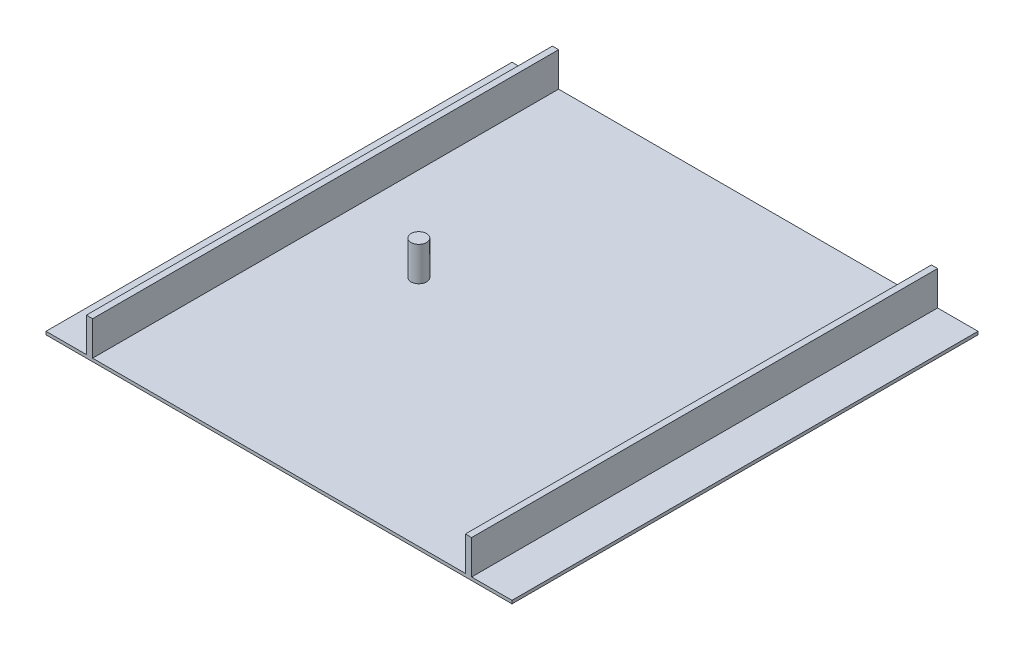
ISO-10303-21;
HEADER;
FILE_DESCRIPTION(('STEP AP214'),'2;1');
FILE_NAME('part.step','',(''),(''),'','','');
FILE_SCHEMA(('AUTOMOTIVE_DESIGN { 1 0 10303 214 1 1 1 1 }'));
ENDSEC;
DATA;
#1=APPLICATION_CONTEXT('core data for automotive mechanical design processes');
#2=APPLICATION_PROTOCOL_DEFINITION('international standard','automotive_design',2000,#1);
#3=PRODUCT_CONTEXT('',#1,'mechanical');
#4=PRODUCT('Part','Part','',(#3));
#5=PRODUCT_RELATED_PRODUCT_CATEGORY('part','',(#4));
#6=PRODUCT_DEFINITION_FORMATION('','',#4);
#7=PRODUCT_DEFINITION_CONTEXT('part definition',#1,'design');
#8=PRODUCT_DEFINITION('design','',#6,#7);
#9=PRODUCT_DEFINITION_SHAPE('','',#8);
#10=(LENGTH_UNIT() NAMED_UNIT(*) SI_UNIT(.MILLI.,.METRE.));
#11=(NAMED_UNIT(*) PLANE_ANGLE_UNIT() SI_UNIT($,.RADIAN.));
#12=(NAMED_UNIT(*) SI_UNIT($,.STERADIAN.) SOLID_ANGLE_UNIT());
#13=UNCERTAINTY_MEASURE_WITH_UNIT(LENGTH_MEASURE(1.E-05),#10,'distance_accuracy_value','');
#14=(GEOMETRIC_REPRESENTATION_CONTEXT(3) GLOBAL_UNCERTAINTY_ASSIGNED_CONTEXT((#13)) GLOBAL_UNIT_ASSIGNED_CONTEXT((#10,
#11,#12)) REPRESENTATION_CONTEXT('',''));
#15=CARTESIAN_POINT('',(0.,0.,0.));
#16=DIRECTION('',(0.,0.,1.));
#17=DIRECTION('',(1.,0.,0.));
#18=AXIS2_PLACEMENT_3D('',#15,#16,#17);
#19=CARTESIAN_POINT('',(0.,10.,0.));
#20=DIRECTION('',(0.,1.,0.));
#21=DIRECTION('',(0.,0.,1.));
#22=AXIS2_PLACEMENT_3D('',#19,#20,#21);
#23=PLANE('',#22);
#24=DIRECTION('',(1.,0.,0.));
#25=VECTOR('',#24,1.);
#26=CARTESIAN_POINT('',(-750.,10.,750.));
#27=LINE('',#26,#25);
#28=CARTESIAN_POINT('',(-750.,10.,750.));
#29=VERTEX_POINT('',#28);
#30=CARTESIAN_POINT('',(-620.,10.,750.));
#31=VERTEX_POINT('',#30);
#32=EDGE_CURVE('E62',#29,#31,#27,.T.);
#33=ORIENTED_EDGE('',*,*,#32,.T.);
#34=DIRECTION('',(0.,0.,1.));
#35=VECTOR('',#34,1.);
#36=CARTESIAN_POINT('',(-620.,10.,-750.));
#37=LINE('',#36,#35);
#38=CARTESIAN_POINT('',(-620.,10.,-750.));
#39=VERTEX_POINT('',#38);
#40=EDGE_CURVE('E150',#39,#31,#37,.T.);
#41=ORIENTED_EDGE('',*,*,#40,.F.);
#42=DIRECTION('',(-1.,0.,0.));
#43=VECTOR('',#42,1.);
#44=CARTESIAN_POINT('',(-750.,10.,-750.));
#45=LINE('',#44,#43);
#46=CARTESIAN_POINT('',(-750.,10.,-750.));
#47=VERTEX_POINT('',#46);
#48=EDGE_CURVE('E182',#39,#47,#45,.T.);
#49=ORIENTED_EDGE('',*,*,#48,.T.);
#50=DIRECTION('',(0.,0.,1.));
#51=VECTOR('',#50,1.);
#52=CARTESIAN_POINT('',(-750.,10.,-750.));
#53=LINE('',#52,#51);
#54=EDGE_CURVE('E188',#47,#29,#53,.T.);
#55=ORIENTED_EDGE('',*,*,#54,.T.);
#56=EDGE_LOOP('',(#33,#41,#49,#55));
#57=FACE_BOUND('',#56,.T.);
#58=ADVANCED_FACE('F36',(#57),#23,.T.);
#59=CARTESIAN_POINT('',(-300.,10.,0.));
#60=DIRECTION('',(0.,1.,0.));
#61=DIRECTION('',(0.,0.,1.));
#62=AXIS2_PLACEMENT_3D('',#59,#60,#61);
#63=CIRCLE('',#62,25.);
#64=CARTESIAN_POINT('',(-300.,10.,25.));
#65=VERTEX_POINT('',#64);
#66=EDGE_CURVE('E379',#65,#65,#63,.T.);
#67=ORIENTED_EDGE('',*,*,#66,.F.);
#68=EDGE_LOOP('',(#67));
#69=FACE_BOUND('',#68,.T.);
#70=CARTESIAN_POINT('',(600.,10.,-750.));
#71=VERTEX_POINT('',#70);
#72=CARTESIAN_POINT('',(-600.,10.,-750.));
#73=VERTEX_POINT('',#72);
#74=EDGE_CURVE('E184',#71,#73,#45,.T.);
#75=ORIENTED_EDGE('',*,*,#74,.T.);
#76=DIRECTION('',(0.,0.,-1.));
#77=VECTOR('',#76,1.);
#78=CARTESIAN_POINT('',(-600.,10.,-750.));
#79=LINE('',#78,#77);
#80=CARTESIAN_POINT('',(-600.,10.,750.));
#81=VERTEX_POINT('',#80);
#82=EDGE_CURVE('E54',#81,#73,#79,.T.);
#83=ORIENTED_EDGE('',*,*,#82,.F.);
#84=CARTESIAN_POINT('',(600.,10.,750.));
#85=VERTEX_POINT('',#84);
#86=EDGE_CURVE('E40',#81,#85,#27,.T.);
#87=ORIENTED_EDGE('',*,*,#86,.T.);
#88=DIRECTION('',(0.,0.,1.));
#89=VECTOR('',#88,1.);
#90=CARTESIAN_POINT('',(600.,10.,-750.));
#91=LINE('',#90,#89);
#92=EDGE_CURVE('E154',#71,#85,#91,.T.);
#93=ORIENTED_EDGE('',*,*,#92,.F.);
#94=EDGE_LOOP('',(#75,#83,#87,#93));
#95=FACE_BOUND('',#94,.T.);
#96=ADVANCED_FACE('F273',(#69,#95),#23,.T.);
#97=DIRECTION('',(0.,0.,-1.));
#98=VECTOR('',#97,1.);
#99=CARTESIAN_POINT('',(620.,10.,-750.));
#100=LINE('',#99,#98);
#101=CARTESIAN_POINT('',(620.,10.,750.));
#102=VERTEX_POINT('',#101);
#103=CARTESIAN_POINT('',(620.,10.,-750.));
#104=VERTEX_POINT('',#103);
#105=EDGE_CURVE('E151',#102,#104,#100,.T.);
#106=ORIENTED_EDGE('',*,*,#105,.F.);
#107=CARTESIAN_POINT('',(750.,10.,750.));
#108=VERTEX_POINT('',#107);
#109=EDGE_CURVE('E217',#102,#108,#27,.T.);
#110=ORIENTED_EDGE('',*,*,#109,.T.);
#111=DIRECTION('',(0.,0.,-1.));
#112=VECTOR('',#111,1.);
#113=CARTESIAN_POINT('',(750.,10.,-750.));
#114=LINE('',#113,#112);
#115=CARTESIAN_POINT('',(750.,10.,-750.));
#116=VERTEX_POINT('',#115);
#117=EDGE_CURVE('E185',#108,#116,#114,.T.);
#118=ORIENTED_EDGE('',*,*,#117,.T.);
#119=EDGE_CURVE('E194',#116,#104,#45,.T.);
#120=ORIENTED_EDGE('',*,*,#119,.T.);
#121=EDGE_LOOP('',(#106,#110,#118,#120));
#122=FACE_BOUND('',#121,.T.);
#123=ADVANCED_FACE('F275',(#122),#23,.T.);
#124=CARTESIAN_POINT('',(750.,10.,-750.));
#125=DIRECTION('',(-1.,0.,0.));
#126=DIRECTION('',(0.,0.,1.));
#127=AXIS2_PLACEMENT_3D('',#124,#125,#126);
#128=PLANE('',#127);
#129=DIRECTION('',(0.,0.,-1.));
#130=VECTOR('',#129,1.);
#131=CARTESIAN_POINT('',(750.,0.,-750.));
#132=LINE('',#131,#130);
#133=CARTESIAN_POINT('',(750.,0.,750.));
#134=VERTEX_POINT('',#133);
#135=CARTESIAN_POINT('',(750.,0.,-750.));
#136=VERTEX_POINT('',#135);
#137=EDGE_CURVE('E210',#134,#136,#132,.T.);
#138=ORIENTED_EDGE('',*,*,#137,.T.);
#139=DIRECTION('',(0.,-1.,0.));
#140=VECTOR('',#139,1.);
#141=CARTESIAN_POINT('',(750.,10.,-750.));
#142=LINE('',#141,#140);
#143=EDGE_CURVE('E11',#116,#136,#142,.T.);
#144=ORIENTED_EDGE('',*,*,#143,.F.);
#145=ORIENTED_EDGE('',*,*,#117,.F.);
#146=DIRECTION('',(0.,-1.,0.));
#147=VECTOR('',#146,1.);
#148=CARTESIAN_POINT('',(750.,10.,750.));
#149=LINE('',#148,#147);
#150=EDGE_CURVE('E201',#108,#134,#149,.T.);
#151=ORIENTED_EDGE('',*,*,#150,.T.);
#152=EDGE_LOOP('',(#138,#144,#145,#151));
#153=FACE_BOUND('',#152,.T.);
#154=ADVANCED_FACE('F38',(#153),#128,.F.);
#155=CARTESIAN_POINT('',(-750.,10.,-750.));
#156=DIRECTION('',(0.,0.,1.));
#157=DIRECTION('',(1.,0.,0.));
#158=AXIS2_PLACEMENT_3D('',#155,#156,#157);
#159=PLANE('',#158);
#160=DIRECTION('',(-1.,0.,0.));
#161=VECTOR('',#160,1.);
#162=CARTESIAN_POINT('',(-750.,0.,-750.));
#163=LINE('',#162,#161);
#164=CARTESIAN_POINT('',(-750.,0.,-750.));
#165=VERTEX_POINT('',#164);
#166=EDGE_CURVE('E208',#136,#165,#163,.T.);
#167=ORIENTED_EDGE('',*,*,#166,.T.);
#168=DIRECTION('',(0.,-1.,0.));
#169=VECTOR('',#168,1.);
#170=CARTESIAN_POINT('',(-750.,10.,-750.));
#171=LINE('',#170,#169);
#172=EDGE_CURVE('E46',#47,#165,#171,.T.);
#173=ORIENTED_EDGE('',*,*,#172,.F.);
#174=ORIENTED_EDGE('',*,*,#48,.F.);
#175=DIRECTION('',(0.,-1.,0.));
#176=VECTOR('',#175,1.);
#177=CARTESIAN_POINT('',(-620.,120.,-750.));
#178=LINE('',#177,#176);
#179=CARTESIAN_POINT('',(-620.,120.,-750.));
#180=VERTEX_POINT('',#179);
#181=EDGE_CURVE('E386',#180,#39,#178,.T.);
#182=ORIENTED_EDGE('',*,*,#181,.F.);
#183=DIRECTION('',(-1.,0.,0.));
#184=VECTOR('',#183,1.);
#185=CARTESIAN_POINT('',(-620.,120.,-750.));
#186=LINE('',#185,#184);
#187=CARTESIAN_POINT('',(-600.,120.,-750.));
#188=VERTEX_POINT('',#187);
#189=EDGE_CURVE('E144',#188,#180,#186,.T.);
#190=ORIENTED_EDGE('',*,*,#189,.F.);
#191=DIRECTION('',(0.,-1.,0.));
#192=VECTOR('',#191,1.);
#193=CARTESIAN_POINT('',(-600.,120.,-750.));
#194=LINE('',#193,#192);
#195=EDGE_CURVE('E156',#188,#73,#194,.T.);
#196=ORIENTED_EDGE('',*,*,#195,.T.);
#197=ORIENTED_EDGE('',*,*,#74,.F.);
#198=DIRECTION('',(0.,-1.,0.));
#199=VECTOR('',#198,1.);
#200=CARTESIAN_POINT('',(600.,120.,-750.));
#201=LINE('',#200,#199);
#202=CARTESIAN_POINT('',(600.,120.,-750.));
#203=VERTEX_POINT('',#202);
#204=EDGE_CURVE('E251',#203,#71,#201,.T.);
#205=ORIENTED_EDGE('',*,*,#204,.F.);
#206=DIRECTION('',(-1.,0.,0.));
#207=VECTOR('',#206,1.);
#208=CARTESIAN_POINT('',(600.,120.,-750.));
#209=LINE('',#208,#207);
#210=CARTESIAN_POINT('',(620.,120.,-750.));
#211=VERTEX_POINT('',#210);
#212=EDGE_CURVE('E163',#211,#203,#209,.T.);
#213=ORIENTED_EDGE('',*,*,#212,.F.);
#214=DIRECTION('',(0.,-1.,0.));
#215=VECTOR('',#214,1.);
#216=CARTESIAN_POINT('',(620.,120.,-750.));
#217=LINE('',#216,#215);
#218=EDGE_CURVE('E212',#211,#104,#217,.T.);
#219=ORIENTED_EDGE('',*,*,#218,.T.);
#220=ORIENTED_EDGE('',*,*,#119,.F.);
#221=ORIENTED_EDGE('',*,*,#143,.T.);
#222=EDGE_LOOP('',(#167,#173,#174,#182,#190,#196,#197,#205,#213,#219,#220,#221));
#223=FACE_BOUND('',#222,.T.);
#224=ADVANCED_FACE('F260',(#223),#159,.F.);
#225=CARTESIAN_POINT('',(-750.,10.,-750.));
#226=DIRECTION('',(1.,0.,0.));
#227=DIRECTION('',(0.,0.,-1.));
#228=AXIS2_PLACEMENT_3D('',#225,#226,#227);
#229=PLANE('',#228);
#230=DIRECTION('',(0.,0.,1.));
#231=VECTOR('',#230,1.);
#232=CARTESIAN_POINT('',(-750.,0.,-750.));
#233=LINE('',#232,#231);
#234=CARTESIAN_POINT('',(-750.,0.,750.));
#235=VERTEX_POINT('',#234);
#236=EDGE_CURVE('E206',#165,#235,#233,.T.);
#237=ORIENTED_EDGE('',*,*,#236,.T.);
#238=DIRECTION('',(0.,-1.,0.));
#239=VECTOR('',#238,1.);
#240=CARTESIAN_POINT('',(-750.,10.,750.));
#241=LINE('',#240,#239);
#242=EDGE_CURVE('E198',#29,#235,#241,.T.);
#243=ORIENTED_EDGE('',*,*,#242,.F.);
#244=ORIENTED_EDGE('',*,*,#54,.F.);
#245=ORIENTED_EDGE('',*,*,#172,.T.);
#246=EDGE_LOOP('',(#237,#243,#244,#245));
#247=FACE_BOUND('',#246,.T.);
#248=ADVANCED_FACE('F228',(#247),#229,.F.);
#249=CARTESIAN_POINT('',(-750.,10.,750.));
#250=DIRECTION('',(0.,0.,-1.));
#251=DIRECTION('',(-1.,0.,0.));
#252=AXIS2_PLACEMENT_3D('',#249,#250,#251);
#253=PLANE('',#252);
#254=DIRECTION('',(1.,0.,0.));
#255=VECTOR('',#254,1.);
#256=CARTESIAN_POINT('',(-750.,0.,750.));
#257=LINE('',#256,#255);
#258=EDGE_CURVE('E204',#235,#134,#257,.T.);
#259=ORIENTED_EDGE('',*,*,#258,.T.);
#260=ORIENTED_EDGE('',*,*,#150,.F.);
#261=ORIENTED_EDGE('',*,*,#109,.F.);
#262=DIRECTION('',(0.,-1.,0.));
#263=VECTOR('',#262,1.);
#264=CARTESIAN_POINT('',(620.,120.,750.));
#265=LINE('',#264,#263);
#266=CARTESIAN_POINT('',(620.,120.,750.));
#267=VERTEX_POINT('',#266);
#268=EDGE_CURVE('E169',#267,#102,#265,.T.);
#269=ORIENTED_EDGE('',*,*,#268,.F.);
#270=DIRECTION('',(1.,0.,0.));
#271=VECTOR('',#270,1.);
#272=CARTESIAN_POINT('',(600.,120.,750.));
#273=LINE('',#272,#271);
#274=CARTESIAN_POINT('',(600.,120.,750.));
#275=VERTEX_POINT('',#274);
#276=EDGE_CURVE('E167',#275,#267,#273,.T.);
#277=ORIENTED_EDGE('',*,*,#276,.F.);
#278=DIRECTION('',(0.,-1.,0.));
#279=VECTOR('',#278,1.);
#280=CARTESIAN_POINT('',(600.,120.,750.));
#281=LINE('',#280,#279);
#282=EDGE_CURVE('E180',#275,#85,#281,.T.);
#283=ORIENTED_EDGE('',*,*,#282,.T.);
#284=ORIENTED_EDGE('',*,*,#86,.F.);
#285=DIRECTION('',(0.,-1.,0.));
#286=VECTOR('',#285,1.);
#287=CARTESIAN_POINT('',(-600.,120.,750.));
#288=LINE('',#287,#286);
#289=CARTESIAN_POINT('',(-600.,120.,750.));
#290=VERTEX_POINT('',#289);
#291=EDGE_CURVE('E135',#290,#81,#288,.T.);
#292=ORIENTED_EDGE('',*,*,#291,.F.);
#293=DIRECTION('',(1.,0.,0.));
#294=VECTOR('',#293,1.);
#295=CARTESIAN_POINT('',(-620.,120.,750.));
#296=LINE('',#295,#294);
#297=CARTESIAN_POINT('',(-620.,120.,750.));
#298=VERTEX_POINT('',#297);
#299=EDGE_CURVE('E128',#298,#290,#296,.T.);
#300=ORIENTED_EDGE('',*,*,#299,.F.);
#301=DIRECTION('',(0.,-1.,0.));
#302=VECTOR('',#301,1.);
#303=CARTESIAN_POINT('',(-620.,120.,750.));
#304=LINE('',#303,#302);
#305=EDGE_CURVE('E132',#298,#31,#304,.T.);
#306=ORIENTED_EDGE('',*,*,#305,.T.);
#307=ORIENTED_EDGE('',*,*,#32,.F.);
#308=ORIENTED_EDGE('',*,*,#242,.T.);
#309=EDGE_LOOP('',(#259,#260,#261,#269,#277,#283,#284,#292,#300,#306,#307,#308));
#310=FACE_BOUND('',#309,.T.);
#311=ADVANCED_FACE('F130',(#310),#253,.F.);
#312=CARTESIAN_POINT('',(0.,0.,0.));
#313=DIRECTION('',(0.,1.,0.));
#314=DIRECTION('',(0.,0.,1.));
#315=AXIS2_PLACEMENT_3D('',#312,#313,#314);
#316=PLANE('',#315);
#317=ORIENTED_EDGE('',*,*,#137,.F.);
#318=ORIENTED_EDGE('',*,*,#258,.F.);
#319=ORIENTED_EDGE('',*,*,#236,.F.);
#320=ORIENTED_EDGE('',*,*,#166,.F.);
#321=EDGE_LOOP('',(#317,#318,#319,#320));
#322=FACE_BOUND('',#321,.T.);
#323=ADVANCED_FACE('F233',(#322),#316,.F.);
#324=CARTESIAN_POINT('',(620.,120.,-750.));
#325=DIRECTION('',(-1.,0.,0.));
#326=DIRECTION('',(0.,0.,1.));
#327=AXIS2_PLACEMENT_3D('',#324,#325,#326);
#328=PLANE('',#327);
#329=ORIENTED_EDGE('',*,*,#105,.T.);
#330=ORIENTED_EDGE('',*,*,#218,.F.);
#331=DIRECTION('',(0.,0.,-1.));
#332=VECTOR('',#331,1.);
#333=CARTESIAN_POINT('',(620.,120.,-750.));
#334=LINE('',#333,#332);
#335=EDGE_CURVE('E160',#267,#211,#334,.T.);
#336=ORIENTED_EDGE('',*,*,#335,.F.);
#337=ORIENTED_EDGE('',*,*,#268,.T.);
#338=EDGE_LOOP('',(#329,#330,#336,#337));
#339=FACE_BOUND('',#338,.T.);
#340=ADVANCED_FACE('F241',(#339),#328,.F.);
#341=CARTESIAN_POINT('',(600.,120.,-750.));
#342=DIRECTION('',(1.,0.,0.));
#343=DIRECTION('',(0.,0.,-1.));
#344=AXIS2_PLACEMENT_3D('',#341,#342,#343);
#345=PLANE('',#344);
#346=ORIENTED_EDGE('',*,*,#92,.T.);
#347=ORIENTED_EDGE('',*,*,#282,.F.);
#348=DIRECTION('',(0.,0.,1.));
#349=VECTOR('',#348,1.);
#350=CARTESIAN_POINT('',(600.,120.,-750.));
#351=LINE('',#350,#349);
#352=EDGE_CURVE('E165',#203,#275,#351,.T.);
#353=ORIENTED_EDGE('',*,*,#352,.F.);
#354=ORIENTED_EDGE('',*,*,#204,.T.);
#355=EDGE_LOOP('',(#346,#347,#353,#354));
#356=FACE_BOUND('',#355,.T.);
#357=ADVANCED_FACE('F263',(#356),#345,.F.);
#358=CARTESIAN_POINT('',(0.,120.,0.));
#359=DIRECTION('',(0.,1.,0.));
#360=DIRECTION('',(0.,0.,1.));
#361=AXIS2_PLACEMENT_3D('',#358,#359,#360);
#362=PLANE('',#361);
#363=ORIENTED_EDGE('',*,*,#335,.T.);
#364=ORIENTED_EDGE('',*,*,#212,.T.);
#365=ORIENTED_EDGE('',*,*,#352,.T.);
#366=ORIENTED_EDGE('',*,*,#276,.T.);
#367=EDGE_LOOP('',(#363,#364,#365,#366));
#368=FACE_BOUND('',#367,.T.);
#369=ADVANCED_FACE('F245',(#368),#362,.T.);
#370=CARTESIAN_POINT('',(-620.,120.,-750.));
#371=DIRECTION('',(1.,0.,0.));
#372=DIRECTION('',(0.,0.,-1.));
#373=AXIS2_PLACEMENT_3D('',#370,#371,#372);
#374=PLANE('',#373);
#375=ORIENTED_EDGE('',*,*,#40,.T.);
#376=ORIENTED_EDGE('',*,*,#305,.F.);
#377=DIRECTION('',(0.,0.,1.));
#378=VECTOR('',#377,1.);
#379=CARTESIAN_POINT('',(-620.,120.,-750.));
#380=LINE('',#379,#378);
#381=EDGE_CURVE('E139',#180,#298,#380,.T.);
#382=ORIENTED_EDGE('',*,*,#381,.F.);
#383=ORIENTED_EDGE('',*,*,#181,.T.);
#384=EDGE_LOOP('',(#375,#376,#382,#383));
#385=FACE_BOUND('',#384,.T.);
#386=ADVANCED_FACE('F149',(#385),#374,.F.);
#387=CARTESIAN_POINT('',(-600.,120.,-750.));
#388=DIRECTION('',(-1.,0.,0.));
#389=DIRECTION('',(0.,0.,1.));
#390=AXIS2_PLACEMENT_3D('',#387,#388,#389);
#391=PLANE('',#390);
#392=ORIENTED_EDGE('',*,*,#82,.T.);
#393=ORIENTED_EDGE('',*,*,#195,.F.);
#394=DIRECTION('',(0.,0.,-1.));
#395=VECTOR('',#394,1.);
#396=CARTESIAN_POINT('',(-600.,120.,-750.));
#397=LINE('',#396,#395);
#398=EDGE_CURVE('E138',#290,#188,#397,.T.);
#399=ORIENTED_EDGE('',*,*,#398,.F.);
#400=ORIENTED_EDGE('',*,*,#291,.T.);
#401=EDGE_LOOP('',(#392,#393,#399,#400));
#402=FACE_BOUND('',#401,.T.);
#403=ADVANCED_FACE('F325',(#402),#391,.F.);
#404=CARTESIAN_POINT('',(0.,120.,0.));
#405=DIRECTION('',(0.,1.,0.));
#406=DIRECTION('',(0.,0.,1.));
#407=AXIS2_PLACEMENT_3D('',#404,#405,#406);
#408=PLANE('',#407);
#409=ORIENTED_EDGE('',*,*,#381,.T.);
#410=ORIENTED_EDGE('',*,*,#299,.T.);
#411=ORIENTED_EDGE('',*,*,#398,.T.);
#412=ORIENTED_EDGE('',*,*,#189,.T.);
#413=EDGE_LOOP('',(#409,#410,#411,#412));
#414=FACE_BOUND('',#413,.T.);
#415=ADVANCED_FACE('F142',(#414),#408,.T.);
#416=CARTESIAN_POINT('',(-300.,190.710678118655,0.));
#417=DIRECTION('',(0.,-1.,0.));
#418=DIRECTION('',(0.,0.,-1.));
#419=AXIS2_PLACEMENT_3D('',#416,#417,#418);
#420=CYLINDRICAL_SURFACE('',#419,25.);
#421=ORIENTED_EDGE('',*,*,#66,.T.);
#422=EDGE_LOOP('',(#421));
#423=FACE_BOUND('',#422,.T.);
#424=CARTESIAN_POINT('',(-300.,120.,0.));
#425=DIRECTION('',(0.,1.,0.));
#426=DIRECTION('',(0.,0.,1.));
#427=AXIS2_PLACEMENT_3D('',#424,#425,#426);
#428=CIRCLE('',#427,25.);
#429=CARTESIAN_POINT('',(-300.,120.,25.));
#430=VERTEX_POINT('',#429);
#431=EDGE_CURVE('E377',#430,#430,#428,.T.);
#432=ORIENTED_EDGE('',*,*,#431,.F.);
#433=EDGE_LOOP('',(#432));
#434=FACE_BOUND('',#433,.T.);
#435=ADVANCED_FACE('F343',(#423,#434),#420,.T.);
#436=CARTESIAN_POINT('',(0.,120.,0.));
#437=DIRECTION('',(0.,1.,0.));
#438=DIRECTION('',(0.,0.,1.));
#439=AXIS2_PLACEMENT_3D('',#436,#437,#438);
#440=PLANE('',#439);
#441=ORIENTED_EDGE('',*,*,#431,.T.);
#442=EDGE_LOOP('',(#441));
#443=FACE_BOUND('',#442,.T.);
#444=ADVANCED_FACE('F361',(#443),#440,.T.);
#445=CLOSED_SHELL('',(#58,#96,#123,#154,#224,#248,#311,#323,#340,#357,#369,#386,#403,#415,#435,#444));
#446=MANIFOLD_SOLID_BREP('B2',#445);
#447=ADVANCED_BREP_SHAPE_REPRESENTATION('',(#18,#446),#14);
#448=SHAPE_DEFINITION_REPRESENTATION(#9,#447);
ENDSEC;
END-ISO-10303-21;
